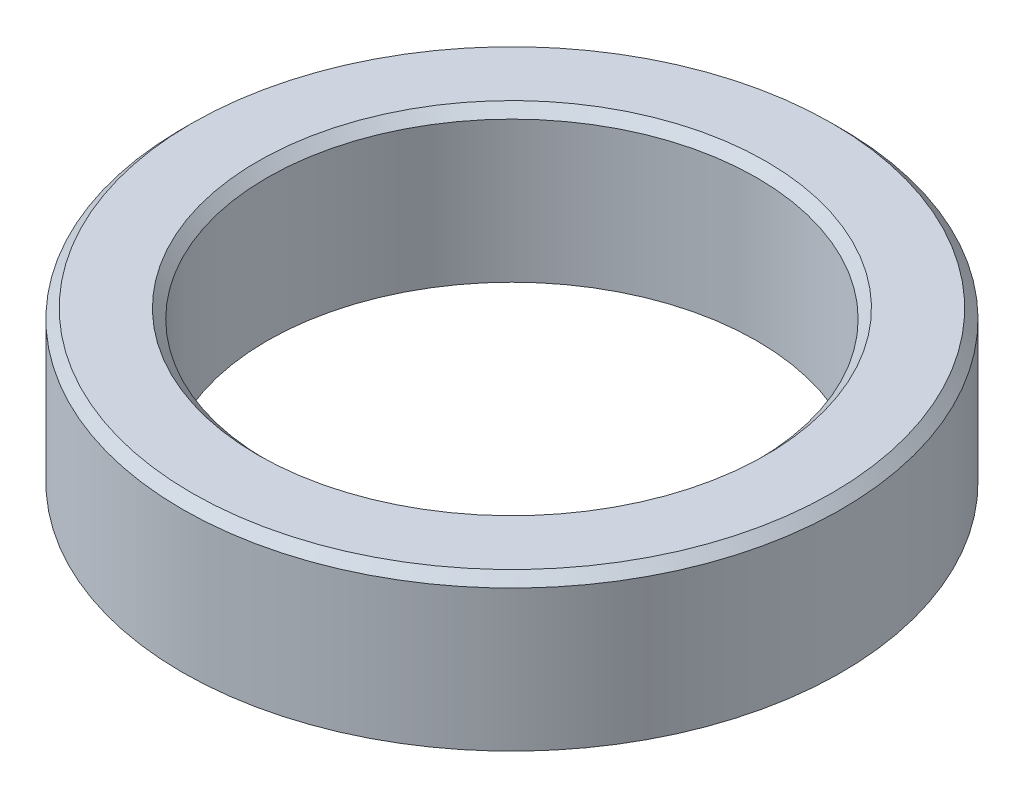
ISO-10303-21;
HEADER;
FILE_DESCRIPTION(('STEP AP214'),'2;1');
FILE_NAME('part.step','',(''),(''),'','','');
FILE_SCHEMA(('AUTOMOTIVE_DESIGN { 1 0 10303 214 1 1 1 1 }'));
ENDSEC;
DATA;
#1=APPLICATION_CONTEXT('core data for automotive mechanical design processes');
#2=APPLICATION_PROTOCOL_DEFINITION('international standard','automotive_design',2000,#1);
#3=PRODUCT_CONTEXT('',#1,'mechanical');
#4=PRODUCT('Part','Part','',(#3));
#5=PRODUCT_RELATED_PRODUCT_CATEGORY('part','',(#4));
#6=PRODUCT_DEFINITION_FORMATION('','',#4);
#7=PRODUCT_DEFINITION_CONTEXT('part definition',#1,'design');
#8=PRODUCT_DEFINITION('design','',#6,#7);
#9=PRODUCT_DEFINITION_SHAPE('','',#8);
#10=(LENGTH_UNIT() NAMED_UNIT(*) SI_UNIT(.MILLI.,.METRE.));
#11=(NAMED_UNIT(*) PLANE_ANGLE_UNIT() SI_UNIT($,.RADIAN.));
#12=(NAMED_UNIT(*) SI_UNIT($,.STERADIAN.) SOLID_ANGLE_UNIT());
#13=UNCERTAINTY_MEASURE_WITH_UNIT(LENGTH_MEASURE(1.E-05),#10,'distance_accuracy_value','');
#14=(GEOMETRIC_REPRESENTATION_CONTEXT(3) GLOBAL_UNCERTAINTY_ASSIGNED_CONTEXT((#13)) GLOBAL_UNIT_ASSIGNED_CONTEXT((#10,
#11,#12)) REPRESENTATION_CONTEXT('',''));
#15=CARTESIAN_POINT('',(0.,0.,0.));
#16=DIRECTION('',(0.,0.,1.));
#17=DIRECTION('',(1.,0.,0.));
#18=AXIS2_PLACEMENT_3D('',#15,#16,#17);
#19=CARTESIAN_POINT('',(0.,9.525,0.));
#20=DIRECTION('',(0.,1.,0.));
#21=DIRECTION('',(0.,0.,1.));
#22=AXIS2_PLACEMENT_3D('',#19,#20,#21);
#23=CONICAL_SURFACE('',#22,16.51,0.785398163397448);
#24=CARTESIAN_POINT('',(0.,9.525,0.));
#25=DIRECTION('',(0.,1.,0.));
#26=DIRECTION('',(0.,0.,1.));
#27=AXIS2_PLACEMENT_3D('',#24,#25,#26);
#28=CIRCLE('',#27,16.51);
#29=CARTESIAN_POINT('',(0.,9.525,16.51));
#30=VERTEX_POINT('',#29);
#31=EDGE_CURVE('E43',#30,#30,#28,.T.);
#32=ORIENTED_EDGE('',*,*,#31,.F.);
#33=EDGE_LOOP('',(#32));
#34=FACE_BOUND('',#33,.T.);
#35=CARTESIAN_POINT('',(0.,10.16,0.));
#36=DIRECTION('',(0.,1.,0.));
#37=DIRECTION('',(0.,0.,1.));
#38=AXIS2_PLACEMENT_3D('',#35,#36,#37);
#39=CIRCLE('',#38,17.145);
#40=CARTESIAN_POINT('',(0.,10.16,17.145));
#41=VERTEX_POINT('',#40);
#42=EDGE_CURVE('E12',#41,#41,#39,.F.);
#43=ORIENTED_EDGE('',*,*,#42,.F.);
#44=EDGE_LOOP('',(#43));
#45=FACE_BOUND('',#44,.T.);
#46=ADVANCED_FACE('F37',(#34,#45),#23,.F.);
#47=CARTESIAN_POINT('',(0.,10.16,0.));
#48=DIRECTION('',(0.,-1.,0.));
#49=DIRECTION('',(0.,0.,-1.));
#50=AXIS2_PLACEMENT_3D('',#47,#48,#49);
#51=CONICAL_SURFACE('',#50,21.59,0.785398163397448);
#52=CARTESIAN_POINT('',(0.,10.16,0.));
#53=DIRECTION('',(0.,1.,0.));
#54=DIRECTION('',(0.,0.,1.));
#55=AXIS2_PLACEMENT_3D('',#52,#53,#54);
#56=CIRCLE('',#55,21.59);
#57=CARTESIAN_POINT('',(0.,10.16,21.59));
#58=VERTEX_POINT('',#57);
#59=EDGE_CURVE('E51',#58,#58,#56,.T.);
#60=ORIENTED_EDGE('',*,*,#59,.F.);
#61=EDGE_LOOP('',(#60));
#62=FACE_BOUND('',#61,.T.);
#63=CARTESIAN_POINT('',(0.,9.525,0.));
#64=DIRECTION('',(0.,1.,0.));
#65=DIRECTION('',(0.,0.,1.));
#66=AXIS2_PLACEMENT_3D('',#63,#64,#65);
#67=CIRCLE('',#66,22.225);
#68=CARTESIAN_POINT('',(0.,9.525,22.225));
#69=VERTEX_POINT('',#68);
#70=EDGE_CURVE('E47',#69,#69,#67,.F.);
#71=ORIENTED_EDGE('',*,*,#70,.F.);
#72=EDGE_LOOP('',(#71));
#73=FACE_BOUND('',#72,.T.);
#74=ADVANCED_FACE('F76',(#62,#73),#51,.T.);
#75=CARTESIAN_POINT('',(0.,10.16,0.));
#76=DIRECTION('',(0.,1.,0.));
#77=DIRECTION('',(0.,0.,1.));
#78=AXIS2_PLACEMENT_3D('',#75,#76,#77);
#79=PLANE('',#78);
#80=ORIENTED_EDGE('',*,*,#42,.T.);
#81=EDGE_LOOP('',(#80));
#82=FACE_BOUND('',#81,.T.);
#83=ORIENTED_EDGE('',*,*,#59,.T.);
#84=EDGE_LOOP('',(#83));
#85=FACE_BOUND('',#84,.T.);
#86=ADVANCED_FACE('F81',(#82,#85),#79,.T.);
#87=CARTESIAN_POINT('',(0.,0.,0.));
#88=DIRECTION('',(0.,1.,0.));
#89=DIRECTION('',(0.,0.,1.));
#90=AXIS2_PLACEMENT_3D('',#87,#88,#89);
#91=PLANE('',#90);
#92=CARTESIAN_POINT('',(0.,0.,0.));
#93=DIRECTION('',(0.,1.,0.));
#94=DIRECTION('',(0.,0.,1.));
#95=AXIS2_PLACEMENT_3D('',#92,#93,#94);
#96=CIRCLE('',#95,22.225);
#97=CARTESIAN_POINT('',(0.,0.,22.225));
#98=VERTEX_POINT('',#97);
#99=EDGE_CURVE('E56',#98,#98,#96,.T.);
#100=ORIENTED_EDGE('',*,*,#99,.F.);
#101=EDGE_LOOP('',(#100));
#102=FACE_BOUND('',#101,.T.);
#103=CARTESIAN_POINT('',(0.,0.,0.));
#104=DIRECTION('',(0.,1.,0.));
#105=DIRECTION('',(0.,0.,1.));
#106=AXIS2_PLACEMENT_3D('',#103,#104,#105);
#107=CIRCLE('',#106,16.51);
#108=CARTESIAN_POINT('',(0.,0.,16.51));
#109=VERTEX_POINT('',#108);
#110=EDGE_CURVE('E59',#109,#109,#107,.T.);
#111=ORIENTED_EDGE('',*,*,#110,.T.);
#112=EDGE_LOOP('',(#111));
#113=FACE_BOUND('',#112,.T.);
#114=ADVANCED_FACE('F63',(#102,#113),#91,.F.);
#115=CARTESIAN_POINT('',(0.,10.16,0.));
#116=DIRECTION('',(0.,-1.,0.));
#117=DIRECTION('',(0.,0.,-1.));
#118=AXIS2_PLACEMENT_3D('',#115,#116,#117);
#119=CYLINDRICAL_SURFACE('',#118,22.225);
#120=ORIENTED_EDGE('',*,*,#70,.T.);
#121=EDGE_LOOP('',(#120));
#122=FACE_BOUND('',#121,.T.);
#123=ORIENTED_EDGE('',*,*,#99,.T.);
#124=EDGE_LOOP('',(#123));
#125=FACE_BOUND('',#124,.T.);
#126=ADVANCED_FACE('F67',(#122,#125),#119,.T.);
#127=CARTESIAN_POINT('',(0.,10.16,0.));
#128=DIRECTION('',(0.,-1.,0.));
#129=DIRECTION('',(0.,0.,-1.));
#130=AXIS2_PLACEMENT_3D('',#127,#128,#129);
#131=CYLINDRICAL_SURFACE('',#130,16.51);
#132=ORIENTED_EDGE('',*,*,#31,.T.);
#133=EDGE_LOOP('',(#132));
#134=FACE_BOUND('',#133,.T.);
#135=ORIENTED_EDGE('',*,*,#110,.F.);
#136=EDGE_LOOP('',(#135));
#137=FACE_BOUND('',#136,.T.);
#138=ADVANCED_FACE('F65',(#134,#137),#131,.F.);
#139=CLOSED_SHELL('',(#46,#74,#86,#114,#126,#138));
#140=MANIFOLD_SOLID_BREP('B2',#139);
#141=ADVANCED_BREP_SHAPE_REPRESENTATION('',(#18,#140),#14);
#142=SHAPE_DEFINITION_REPRESENTATION(#9,#141);
ENDSEC;
END-ISO-10303-21;
